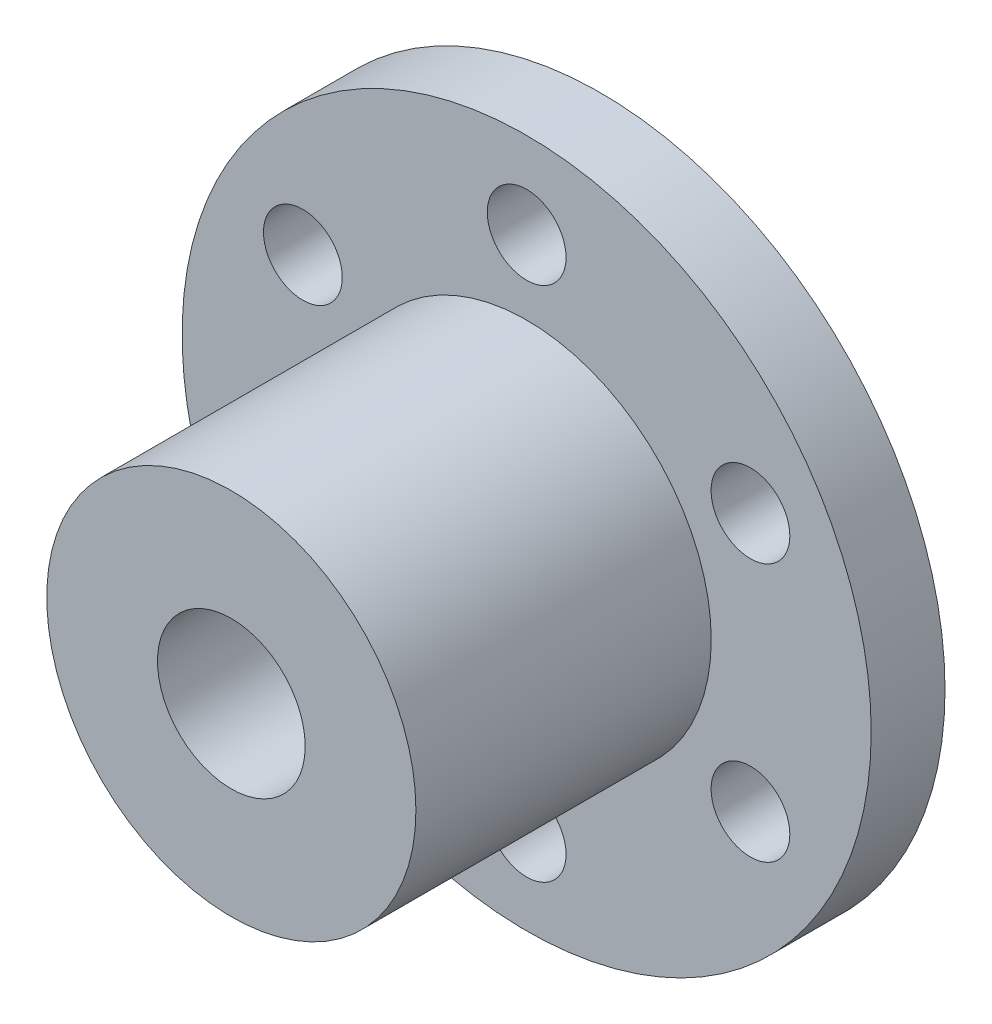
ISO-10303-21;
HEADER;
FILE_DESCRIPTION(('STEP AP214'),'2;1');
FILE_NAME('part.step','',(''),(''),'','','');
FILE_SCHEMA(('AUTOMOTIVE_DESIGN { 1 0 10303 214 1 1 1 1 }'));
ENDSEC;
DATA;
#1=APPLICATION_CONTEXT('core data for automotive mechanical design processes');
#2=APPLICATION_PROTOCOL_DEFINITION('international standard','automotive_design',2000,#1);
#3=PRODUCT_CONTEXT('',#1,'mechanical');
#4=PRODUCT('Part','Part','',(#3));
#5=PRODUCT_RELATED_PRODUCT_CATEGORY('part','',(#4));
#6=PRODUCT_DEFINITION_FORMATION('','',#4);
#7=PRODUCT_DEFINITION_CONTEXT('part definition',#1,'design');
#8=PRODUCT_DEFINITION('design','',#6,#7);
#9=PRODUCT_DEFINITION_SHAPE('','',#8);
#10=(LENGTH_UNIT() NAMED_UNIT(*) SI_UNIT(.MILLI.,.METRE.));
#11=(NAMED_UNIT(*) PLANE_ANGLE_UNIT() SI_UNIT($,.RADIAN.));
#12=(NAMED_UNIT(*) SI_UNIT($,.STERADIAN.) SOLID_ANGLE_UNIT());
#13=UNCERTAINTY_MEASURE_WITH_UNIT(LENGTH_MEASURE(1.E-05),#10,'distance_accuracy_value','');
#14=(GEOMETRIC_REPRESENTATION_CONTEXT(3) GLOBAL_UNCERTAINTY_ASSIGNED_CONTEXT((#13)) GLOBAL_UNIT_ASSIGNED_CONTEXT((#10,
#11,#12)) REPRESENTATION_CONTEXT('',''));
#15=CARTESIAN_POINT('',(0.,0.,0.));
#16=DIRECTION('',(0.,0.,1.));
#17=DIRECTION('',(1.,0.,0.));
#18=AXIS2_PLACEMENT_3D('',#15,#16,#17);
#19=CARTESIAN_POINT('',(0.,0.,3.));
#20=DIRECTION('',(0.,0.,-1.));
#21=DIRECTION('',(-1.,0.,0.));
#22=AXIS2_PLACEMENT_3D('',#19,#20,#21);
#23=CYLINDRICAL_SURFACE('',#22,14.);
#24=CARTESIAN_POINT('',(0.,0.,3.));
#25=DIRECTION('',(0.,0.,1.));
#26=DIRECTION('',(1.,0.,0.));
#27=AXIS2_PLACEMENT_3D('',#24,#25,#26);
#28=CIRCLE('',#27,14.);
#29=CARTESIAN_POINT('',(14.,0.,3.));
#30=VERTEX_POINT('',#29);
#31=EDGE_CURVE('E10',#30,#30,#28,.T.);
#32=ORIENTED_EDGE('',*,*,#31,.F.);
#33=EDGE_LOOP('',(#32));
#34=FACE_BOUND('',#33,.T.);
#35=CARTESIAN_POINT('',(0.,0.,0.));
#36=DIRECTION('',(0.,0.,1.));
#37=DIRECTION('',(1.,0.,0.));
#38=AXIS2_PLACEMENT_3D('',#35,#36,#37);
#39=CIRCLE('',#38,14.);
#40=CARTESIAN_POINT('',(14.,0.,0.));
#41=VERTEX_POINT('',#40);
#42=EDGE_CURVE('E36',#41,#41,#39,.T.);
#43=ORIENTED_EDGE('',*,*,#42,.T.);
#44=EDGE_LOOP('',(#43));
#45=FACE_BOUND('',#44,.T.);
#46=ADVANCED_FACE('F33',(#34,#45),#23,.T.);
#47=CARTESIAN_POINT('',(0.,0.,3.));
#48=DIRECTION('',(0.,0.,1.));
#49=DIRECTION('',(1.,0.,0.));
#50=AXIS2_PLACEMENT_3D('',#47,#48,#49);
#51=PLANE('',#50);
#52=CARTESIAN_POINT('',(9.093266739737,5.25,3.));
#53=DIRECTION('',(0.,0.,1.));
#54=DIRECTION('',(1.,0.,0.));
#55=AXIS2_PLACEMENT_3D('',#52,#53,#54);
#56=CIRCLE('',#55,1.6);
#57=CARTESIAN_POINT('',(10.693266739737,5.25,3.));
#58=VERTEX_POINT('',#57);
#59=EDGE_CURVE('E56',#58,#58,#56,.T.);
#60=ORIENTED_EDGE('',*,*,#59,.F.);
#61=EDGE_LOOP('',(#60));
#62=FACE_BOUND('',#61,.T.);
#63=CARTESIAN_POINT('',(-9.09326673973701,5.25,3.));
#64=DIRECTION('',(0.,0.,1.));
#65=DIRECTION('',(1.,0.,0.));
#66=AXIS2_PLACEMENT_3D('',#63,#64,#65);
#67=CIRCLE('',#66,1.600000000003);
#68=CARTESIAN_POINT('',(-7.49326673973401,5.25,3.));
#69=VERTEX_POINT('',#68);
#70=EDGE_CURVE('E59',#69,#69,#67,.T.);
#71=ORIENTED_EDGE('',*,*,#70,.F.);
#72=EDGE_LOOP('',(#71));
#73=FACE_BOUND('',#72,.T.);
#74=CARTESIAN_POINT('',(0.,-10.5,3.));
#75=DIRECTION('',(0.,0.,1.));
#76=DIRECTION('',(1.,0.,0.));
#77=AXIS2_PLACEMENT_3D('',#74,#75,#76);
#78=CIRCLE('',#77,1.6);
#79=CARTESIAN_POINT('',(1.6,-10.5,3.));
#80=VERTEX_POINT('',#79);
#81=EDGE_CURVE('E62',#80,#80,#78,.T.);
#82=ORIENTED_EDGE('',*,*,#81,.F.);
#83=EDGE_LOOP('',(#82));
#84=FACE_BOUND('',#83,.T.);
#85=CARTESIAN_POINT('',(-9.09326673973701,-5.25,3.));
#86=DIRECTION('',(0.,0.,1.));
#87=DIRECTION('',(1.,0.,0.));
#88=AXIS2_PLACEMENT_3D('',#85,#86,#87);
#89=CIRCLE('',#88,1.59999999999818);
#90=CARTESIAN_POINT('',(-7.49326673973882,-5.25,3.));
#91=VERTEX_POINT('',#90);
#92=EDGE_CURVE('E65',#91,#91,#89,.T.);
#93=ORIENTED_EDGE('',*,*,#92,.F.);
#94=EDGE_LOOP('',(#93));
#95=FACE_BOUND('',#94,.T.);
#96=CARTESIAN_POINT('',(0.,10.5,3.));
#97=DIRECTION('',(0.,0.,1.));
#98=DIRECTION('',(1.,0.,0.));
#99=AXIS2_PLACEMENT_3D('',#96,#97,#98);
#100=CIRCLE('',#99,1.6);
#101=CARTESIAN_POINT('',(1.6,10.5,3.));
#102=VERTEX_POINT('',#101);
#103=EDGE_CURVE('E68',#102,#102,#100,.T.);
#104=ORIENTED_EDGE('',*,*,#103,.F.);
#105=EDGE_LOOP('',(#104));
#106=FACE_BOUND('',#105,.T.);
#107=CARTESIAN_POINT('',(9.093266739737,-5.25,3.));
#108=DIRECTION('',(0.,0.,1.));
#109=DIRECTION('',(1.,0.,0.));
#110=AXIS2_PLACEMENT_3D('',#107,#108,#109);
#111=CIRCLE('',#110,1.5999999999999);
#112=CARTESIAN_POINT('',(10.6932667397369,-5.25,3.));
#113=VERTEX_POINT('',#112);
#114=EDGE_CURVE('E71',#113,#113,#111,.T.);
#115=ORIENTED_EDGE('',*,*,#114,.F.);
#116=EDGE_LOOP('',(#115));
#117=FACE_BOUND('',#116,.T.);
#118=CARTESIAN_POINT('',(0.,0.,3.));
#119=DIRECTION('',(0.,0.,1.));
#120=DIRECTION('',(1.,0.,0.));
#121=AXIS2_PLACEMENT_3D('',#118,#119,#120);
#122=CIRCLE('',#121,7.5);
#123=CARTESIAN_POINT('',(7.5,0.,3.));
#124=VERTEX_POINT('',#123);
#125=EDGE_CURVE('E45',#124,#124,#122,.T.);
#126=ORIENTED_EDGE('',*,*,#125,.F.);
#127=EDGE_LOOP('',(#126));
#128=FACE_BOUND('',#127,.T.);
#129=ORIENTED_EDGE('',*,*,#31,.T.);
#130=EDGE_LOOP('',(#129));
#131=FACE_BOUND('',#130,.T.);
#132=ADVANCED_FACE('F99',(#62,#73,#84,#95,#106,#117,#128,#131),#51,.T.);
#133=CARTESIAN_POINT('',(0.,0.,0.));
#134=DIRECTION('',(0.,0.,1.));
#135=DIRECTION('',(1.,0.,0.));
#136=AXIS2_PLACEMENT_3D('',#133,#134,#135);
#137=PLANE('',#136);
#138=CARTESIAN_POINT('',(9.093266739737,5.25,0.));
#139=DIRECTION('',(0.,0.,-1.));
#140=DIRECTION('',(-1.,0.,0.));
#141=AXIS2_PLACEMENT_3D('',#138,#139,#140);
#142=CIRCLE('',#141,1.6);
#143=CARTESIAN_POINT('',(7.493266739737,5.25,0.));
#144=VERTEX_POINT('',#143);
#145=EDGE_CURVE('E78',#144,#144,#142,.T.);
#146=ORIENTED_EDGE('',*,*,#145,.F.);
#147=EDGE_LOOP('',(#146));
#148=FACE_BOUND('',#147,.T.);
#149=CARTESIAN_POINT('',(-9.09326673973701,5.25,0.));
#150=DIRECTION('',(0.,0.,-1.));
#151=DIRECTION('',(-1.,0.,0.));
#152=AXIS2_PLACEMENT_3D('',#149,#150,#151);
#153=CIRCLE('',#152,1.600000000003);
#154=CARTESIAN_POINT('',(-10.69326673974,5.25,0.));
#155=VERTEX_POINT('',#154);
#156=EDGE_CURVE('E77',#155,#155,#153,.T.);
#157=ORIENTED_EDGE('',*,*,#156,.F.);
#158=EDGE_LOOP('',(#157));
#159=FACE_BOUND('',#158,.T.);
#160=CARTESIAN_POINT('',(0.,-10.5,0.));
#161=DIRECTION('',(0.,0.,-1.));
#162=DIRECTION('',(-1.,0.,0.));
#163=AXIS2_PLACEMENT_3D('',#160,#161,#162);
#164=CIRCLE('',#163,1.6);
#165=CARTESIAN_POINT('',(-1.6,-10.5,0.));
#166=VERTEX_POINT('',#165);
#167=EDGE_CURVE('E82',#166,#166,#164,.T.);
#168=ORIENTED_EDGE('',*,*,#167,.F.);
#169=EDGE_LOOP('',(#168));
#170=FACE_BOUND('',#169,.T.);
#171=CARTESIAN_POINT('',(-9.09326673973701,-5.25,0.));
#172=DIRECTION('',(0.,0.,-1.));
#173=DIRECTION('',(-1.,0.,0.));
#174=AXIS2_PLACEMENT_3D('',#171,#172,#173);
#175=CIRCLE('',#174,1.59999999999818);
#176=CARTESIAN_POINT('',(-10.6932667397352,-5.25,0.));
#177=VERTEX_POINT('',#176);
#178=EDGE_CURVE('E85',#177,#177,#175,.T.);
#179=ORIENTED_EDGE('',*,*,#178,.F.);
#180=EDGE_LOOP('',(#179));
#181=FACE_BOUND('',#180,.T.);
#182=CARTESIAN_POINT('',(0.,10.5,0.));
#183=DIRECTION('',(0.,0.,-1.));
#184=DIRECTION('',(-1.,0.,0.));
#185=AXIS2_PLACEMENT_3D('',#182,#183,#184);
#186=CIRCLE('',#185,1.6);
#187=CARTESIAN_POINT('',(-1.6,10.5,0.));
#188=VERTEX_POINT('',#187);
#189=EDGE_CURVE('E81',#188,#188,#186,.T.);
#190=ORIENTED_EDGE('',*,*,#189,.F.);
#191=EDGE_LOOP('',(#190));
#192=FACE_BOUND('',#191,.T.);
#193=CARTESIAN_POINT('',(9.093266739737,-5.25,0.));
#194=DIRECTION('',(0.,0.,-1.));
#195=DIRECTION('',(-1.,0.,0.));
#196=AXIS2_PLACEMENT_3D('',#193,#194,#195);
#197=CIRCLE('',#196,1.5999999999999);
#198=CARTESIAN_POINT('',(7.4932667397371,-5.25,0.));
#199=VERTEX_POINT('',#198);
#200=EDGE_CURVE('E74',#199,#199,#197,.T.);
#201=ORIENTED_EDGE('',*,*,#200,.F.);
#202=EDGE_LOOP('',(#201));
#203=FACE_BOUND('',#202,.T.);
#204=CARTESIAN_POINT('',(0.,0.,0.));
#205=DIRECTION('',(0.,0.,1.));
#206=DIRECTION('',(1.,0.,0.));
#207=AXIS2_PLACEMENT_3D('',#204,#205,#206);
#208=CIRCLE('',#207,3.);
#209=CARTESIAN_POINT('',(3.,0.,0.));
#210=VERTEX_POINT('',#209);
#211=EDGE_CURVE('E53',#210,#210,#208,.T.);
#212=ORIENTED_EDGE('',*,*,#211,.T.);
#213=EDGE_LOOP('',(#212));
#214=FACE_BOUND('',#213,.T.);
#215=ORIENTED_EDGE('',*,*,#42,.F.);
#216=EDGE_LOOP('',(#215));
#217=FACE_BOUND('',#216,.T.);
#218=ADVANCED_FACE('F95',(#148,#159,#170,#181,#192,#203,#214,#217),#137,.F.);
#219=CARTESIAN_POINT('',(0.,0.,15.));
#220=DIRECTION('',(0.,0.,1.));
#221=DIRECTION('',(1.,0.,0.));
#222=AXIS2_PLACEMENT_3D('',#219,#220,#221);
#223=PLANE('',#222);
#224=CARTESIAN_POINT('',(0.,0.,15.));
#225=DIRECTION('',(0.,0.,1.));
#226=DIRECTION('',(1.,0.,0.));
#227=AXIS2_PLACEMENT_3D('',#224,#225,#226);
#228=CIRCLE('',#227,7.5);
#229=CARTESIAN_POINT('',(7.5,0.,15.));
#230=VERTEX_POINT('',#229);
#231=EDGE_CURVE('E43',#230,#230,#228,.T.);
#232=ORIENTED_EDGE('',*,*,#231,.T.);
#233=EDGE_LOOP('',(#232));
#234=FACE_BOUND('',#233,.T.);
#235=CARTESIAN_POINT('',(0.,0.,15.));
#236=DIRECTION('',(0.,0.,1.));
#237=DIRECTION('',(1.,0.,0.));
#238=AXIS2_PLACEMENT_3D('',#235,#236,#237);
#239=CIRCLE('',#238,3.);
#240=CARTESIAN_POINT('',(3.,0.,15.));
#241=VERTEX_POINT('',#240);
#242=EDGE_CURVE('E48',#241,#241,#239,.T.);
#243=ORIENTED_EDGE('',*,*,#242,.F.);
#244=EDGE_LOOP('',(#243));
#245=FACE_BOUND('',#244,.T.);
#246=ADVANCED_FACE('F98',(#234,#245),#223,.T.);
#247=CARTESIAN_POINT('',(0.,0.,15.));
#248=DIRECTION('',(0.,0.,-1.));
#249=DIRECTION('',(-1.,0.,0.));
#250=AXIS2_PLACEMENT_3D('',#247,#248,#249);
#251=CYLINDRICAL_SURFACE('',#250,7.5);
#252=ORIENTED_EDGE('',*,*,#231,.F.);
#253=EDGE_LOOP('',(#252));
#254=FACE_BOUND('',#253,.T.);
#255=ORIENTED_EDGE('',*,*,#125,.T.);
#256=EDGE_LOOP('',(#255));
#257=FACE_BOUND('',#256,.T.);
#258=ADVANCED_FACE('F121',(#254,#257),#251,.T.);
#259=CARTESIAN_POINT('',(0.,0.,15.));
#260=DIRECTION('',(0.,0.,-1.));
#261=DIRECTION('',(-1.,0.,0.));
#262=AXIS2_PLACEMENT_3D('',#259,#260,#261);
#263=CYLINDRICAL_SURFACE('',#262,3.);
#264=ORIENTED_EDGE('',*,*,#242,.T.);
#265=EDGE_LOOP('',(#264));
#266=FACE_BOUND('',#265,.T.);
#267=ORIENTED_EDGE('',*,*,#211,.F.);
#268=EDGE_LOOP('',(#267));
#269=FACE_BOUND('',#268,.T.);
#270=ADVANCED_FACE('F124',(#266,#269),#263,.F.);
#271=CARTESIAN_POINT('',(9.093266739737,-5.25,15.));
#272=DIRECTION('',(0.,0.,-1.));
#273=DIRECTION('',(-1.,0.,0.));
#274=AXIS2_PLACEMENT_3D('',#271,#272,#273);
#275=CYLINDRICAL_SURFACE('',#274,1.5999999999999);
#276=ORIENTED_EDGE('',*,*,#114,.T.);
#277=EDGE_LOOP('',(#276));
#278=FACE_BOUND('',#277,.T.);
#279=ORIENTED_EDGE('',*,*,#200,.T.);
#280=EDGE_LOOP('',(#279));
#281=FACE_BOUND('',#280,.T.);
#282=ADVANCED_FACE('F131',(#278,#281),#275,.F.);
#283=CARTESIAN_POINT('',(0.,10.5,15.));
#284=DIRECTION('',(0.,0.,-1.));
#285=DIRECTION('',(-1.,0.,0.));
#286=AXIS2_PLACEMENT_3D('',#283,#284,#285);
#287=CYLINDRICAL_SURFACE('',#286,1.6);
#288=ORIENTED_EDGE('',*,*,#103,.T.);
#289=EDGE_LOOP('',(#288));
#290=FACE_BOUND('',#289,.T.);
#291=ORIENTED_EDGE('',*,*,#189,.T.);
#292=EDGE_LOOP('',(#291));
#293=FACE_BOUND('',#292,.T.);
#294=ADVANCED_FACE('F135',(#290,#293),#287,.F.);
#295=CARTESIAN_POINT('',(-9.09326673973701,-5.25,15.));
#296=DIRECTION('',(0.,0.,-1.));
#297=DIRECTION('',(-1.,0.,0.));
#298=AXIS2_PLACEMENT_3D('',#295,#296,#297);
#299=CYLINDRICAL_SURFACE('',#298,1.59999999999818);
#300=ORIENTED_EDGE('',*,*,#92,.T.);
#301=EDGE_LOOP('',(#300));
#302=FACE_BOUND('',#301,.T.);
#303=ORIENTED_EDGE('',*,*,#178,.T.);
#304=EDGE_LOOP('',(#303));
#305=FACE_BOUND('',#304,.T.);
#306=ADVANCED_FACE('F93',(#302,#305),#299,.F.);
#307=CARTESIAN_POINT('',(0.,-10.5,15.));
#308=DIRECTION('',(0.,0.,-1.));
#309=DIRECTION('',(-1.,0.,0.));
#310=AXIS2_PLACEMENT_3D('',#307,#308,#309);
#311=CYLINDRICAL_SURFACE('',#310,1.6);
#312=ORIENTED_EDGE('',*,*,#81,.T.);
#313=EDGE_LOOP('',(#312));
#314=FACE_BOUND('',#313,.T.);
#315=ORIENTED_EDGE('',*,*,#167,.T.);
#316=EDGE_LOOP('',(#315));
#317=FACE_BOUND('',#316,.T.);
#318=ADVANCED_FACE('F142',(#314,#317),#311,.F.);
#319=CARTESIAN_POINT('',(-9.09326673973701,5.25,15.));
#320=DIRECTION('',(0.,0.,-1.));
#321=DIRECTION('',(-1.,0.,0.));
#322=AXIS2_PLACEMENT_3D('',#319,#320,#321);
#323=CYLINDRICAL_SURFACE('',#322,1.600000000003);
#324=ORIENTED_EDGE('',*,*,#70,.T.);
#325=EDGE_LOOP('',(#324));
#326=FACE_BOUND('',#325,.T.);
#327=ORIENTED_EDGE('',*,*,#156,.T.);
#328=EDGE_LOOP('',(#327));
#329=FACE_BOUND('',#328,.T.);
#330=ADVANCED_FACE('F140',(#326,#329),#323,.F.);
#331=CARTESIAN_POINT('',(9.093266739737,5.25,15.));
#332=DIRECTION('',(0.,0.,-1.));
#333=DIRECTION('',(-1.,0.,0.));
#334=AXIS2_PLACEMENT_3D('',#331,#332,#333);
#335=CYLINDRICAL_SURFACE('',#334,1.6);
#336=ORIENTED_EDGE('',*,*,#59,.T.);
#337=EDGE_LOOP('',(#336));
#338=FACE_BOUND('',#337,.T.);
#339=ORIENTED_EDGE('',*,*,#145,.T.);
#340=EDGE_LOOP('',(#339));
#341=FACE_BOUND('',#340,.T.);
#342=ADVANCED_FACE('F137',(#338,#341),#335,.F.);
#343=CLOSED_SHELL('',(#46,#132,#218,#246,#258,#270,#282,#294,#306,#318,#330,#342));
#344=MANIFOLD_SOLID_BREP('B2',#343);
#345=ADVANCED_BREP_SHAPE_REPRESENTATION('',(#18,#344),#14);
#346=SHAPE_DEFINITION_REPRESENTATION(#9,#345);
ENDSEC;
END-ISO-10303-21;
